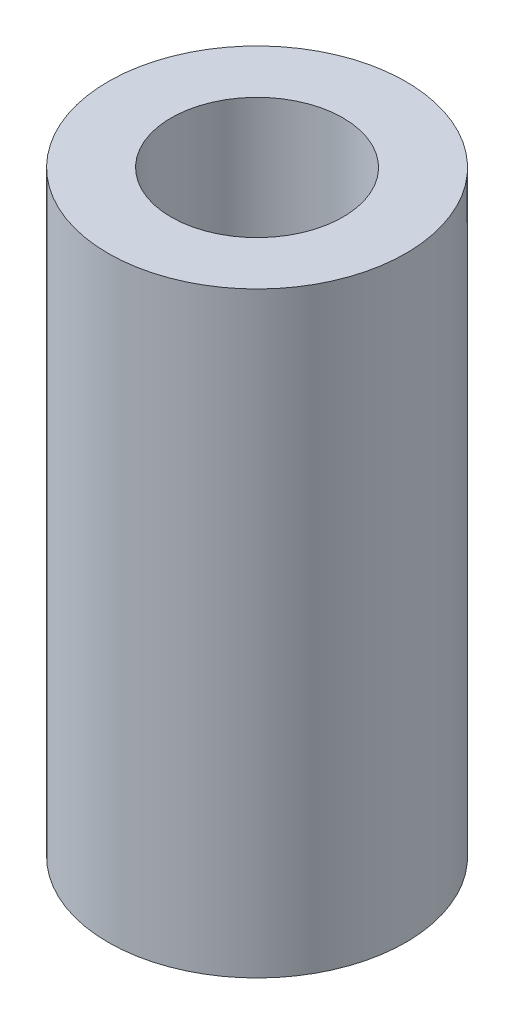
ISO-10303-21;
HEADER;
FILE_DESCRIPTION(('STEP AP214'),'2;1');
FILE_NAME('part.step','',(''),(''),'','','');
FILE_SCHEMA(('AUTOMOTIVE_DESIGN { 1 0 10303 214 1 1 1 1 }'));
ENDSEC;
DATA;
#1=APPLICATION_CONTEXT('core data for automotive mechanical design processes');
#2=APPLICATION_PROTOCOL_DEFINITION('international standard','automotive_design',2000,#1);
#3=PRODUCT_CONTEXT('',#1,'mechanical');
#4=PRODUCT('Part','Part','',(#3));
#5=PRODUCT_RELATED_PRODUCT_CATEGORY('part','',(#4));
#6=PRODUCT_DEFINITION_FORMATION('','',#4);
#7=PRODUCT_DEFINITION_CONTEXT('part definition',#1,'design');
#8=PRODUCT_DEFINITION('design','',#6,#7);
#9=PRODUCT_DEFINITION_SHAPE('','',#8);
#10=(LENGTH_UNIT() NAMED_UNIT(*) SI_UNIT(.MILLI.,.METRE.));
#11=(NAMED_UNIT(*) PLANE_ANGLE_UNIT() SI_UNIT($,.RADIAN.));
#12=(NAMED_UNIT(*) SI_UNIT($,.STERADIAN.) SOLID_ANGLE_UNIT());
#13=UNCERTAINTY_MEASURE_WITH_UNIT(LENGTH_MEASURE(1.E-05),#10,'distance_accuracy_value','');
#14=(GEOMETRIC_REPRESENTATION_CONTEXT(3) GLOBAL_UNCERTAINTY_ASSIGNED_CONTEXT((#13)) GLOBAL_UNIT_ASSIGNED_CONTEXT((#10,
#11,#12)) REPRESENTATION_CONTEXT('',''));
#15=CARTESIAN_POINT('',(0.,0.,0.));
#16=DIRECTION('',(0.,0.,1.));
#17=DIRECTION('',(1.,0.,0.));
#18=AXIS2_PLACEMENT_3D('',#15,#16,#17);
#19=CARTESIAN_POINT('',(0.,30.0652531784366,0.));
#20=DIRECTION('',(0.,-1.,0.));
#21=DIRECTION('',(0.,0.,-1.));
#22=AXIS2_PLACEMENT_3D('',#19,#20,#21);
#23=CYLINDRICAL_SURFACE('',#22,7.5);
#24=CARTESIAN_POINT('',(0.,30.0652531784366,0.));
#25=DIRECTION('',(0.,1.,0.));
#26=DIRECTION('',(0.,0.,1.));
#27=AXIS2_PLACEMENT_3D('',#24,#25,#26);
#28=CIRCLE('',#27,7.5);
#29=CARTESIAN_POINT('',(0.,30.0652531784366,7.5));
#30=VERTEX_POINT('',#29);
#31=EDGE_CURVE('E10',#30,#30,#28,.T.);
#32=ORIENTED_EDGE('',*,*,#31,.F.);
#33=EDGE_LOOP('',(#32));
#34=FACE_BOUND('',#33,.T.);
#35=CARTESIAN_POINT('',(0.,0.,0.));
#36=DIRECTION('',(0.,1.,0.));
#37=DIRECTION('',(0.,0.,1.));
#38=AXIS2_PLACEMENT_3D('',#35,#36,#37);
#39=CIRCLE('',#38,7.5);
#40=CARTESIAN_POINT('',(0.,0.,7.5));
#41=VERTEX_POINT('',#40);
#42=EDGE_CURVE('E37',#41,#41,#39,.T.);
#43=ORIENTED_EDGE('',*,*,#42,.T.);
#44=EDGE_LOOP('',(#43));
#45=FACE_BOUND('',#44,.T.);
#46=ADVANCED_FACE('F40',(#34,#45),#23,.T.);
#47=CARTESIAN_POINT('',(0.,30.0652531784366,0.));
#48=DIRECTION('',(0.,1.,0.));
#49=DIRECTION('',(0.,0.,1.));
#50=AXIS2_PLACEMENT_3D('',#47,#48,#49);
#51=PLANE('',#50);
#52=CARTESIAN_POINT('',(0.,30.0652531784366,0.));
#53=DIRECTION('',(0.,1.,0.));
#54=DIRECTION('',(0.,0.,1.));
#55=AXIS2_PLACEMENT_3D('',#52,#53,#54);
#56=CIRCLE('',#55,4.33055138548107);
#57=CARTESIAN_POINT('',(0.,30.0652531784366,4.33055138548107));
#58=VERTEX_POINT('',#57);
#59=EDGE_CURVE('E50',#58,#58,#56,.T.);
#60=ORIENTED_EDGE('',*,*,#59,.F.);
#61=EDGE_LOOP('',(#60));
#62=FACE_BOUND('',#61,.T.);
#63=ORIENTED_EDGE('',*,*,#31,.T.);
#64=EDGE_LOOP('',(#63));
#65=FACE_BOUND('',#64,.T.);
#66=ADVANCED_FACE('F59',(#62,#65),#51,.T.);
#67=CARTESIAN_POINT('',(0.,0.,0.));
#68=DIRECTION('',(0.,1.,0.));
#69=DIRECTION('',(0.,0.,1.));
#70=AXIS2_PLACEMENT_3D('',#67,#68,#69);
#71=PLANE('',#70);
#72=CARTESIAN_POINT('',(0.,0.,0.));
#73=DIRECTION('',(0.,1.,0.));
#74=DIRECTION('',(0.,0.,1.));
#75=AXIS2_PLACEMENT_3D('',#72,#73,#74);
#76=CIRCLE('',#75,4.33055138548107);
#77=CARTESIAN_POINT('',(0.,0.,4.33055138548107));
#78=VERTEX_POINT('',#77);
#79=EDGE_CURVE('E47',#78,#78,#76,.T.);
#80=ORIENTED_EDGE('',*,*,#79,.T.);
#81=EDGE_LOOP('',(#80));
#82=FACE_BOUND('',#81,.T.);
#83=ORIENTED_EDGE('',*,*,#42,.F.);
#84=EDGE_LOOP('',(#83));
#85=FACE_BOUND('',#84,.T.);
#86=ADVANCED_FACE('F58',(#82,#85),#71,.F.);
#87=CARTESIAN_POINT('',(0.,30.0652531784366,0.));
#88=DIRECTION('',(0.,-1.,0.));
#89=DIRECTION('',(0.,0.,-1.));
#90=AXIS2_PLACEMENT_3D('',#87,#88,#89);
#91=CYLINDRICAL_SURFACE('',#90,4.33055138548107);
#92=ORIENTED_EDGE('',*,*,#59,.T.);
#93=EDGE_LOOP('',(#92));
#94=FACE_BOUND('',#93,.T.);
#95=ORIENTED_EDGE('',*,*,#79,.F.);
#96=EDGE_LOOP('',(#95));
#97=FACE_BOUND('',#96,.T.);
#98=ADVANCED_FACE('F54',(#94,#97),#91,.F.);
#99=CLOSED_SHELL('',(#46,#66,#86,#98));
#100=MANIFOLD_SOLID_BREP('B2',#99);
#101=ADVANCED_BREP_SHAPE_REPRESENTATION('',(#18,#100),#14);
#102=SHAPE_DEFINITION_REPRESENTATION(#9,#101);
ENDSEC;
END-ISO-10303-21;
